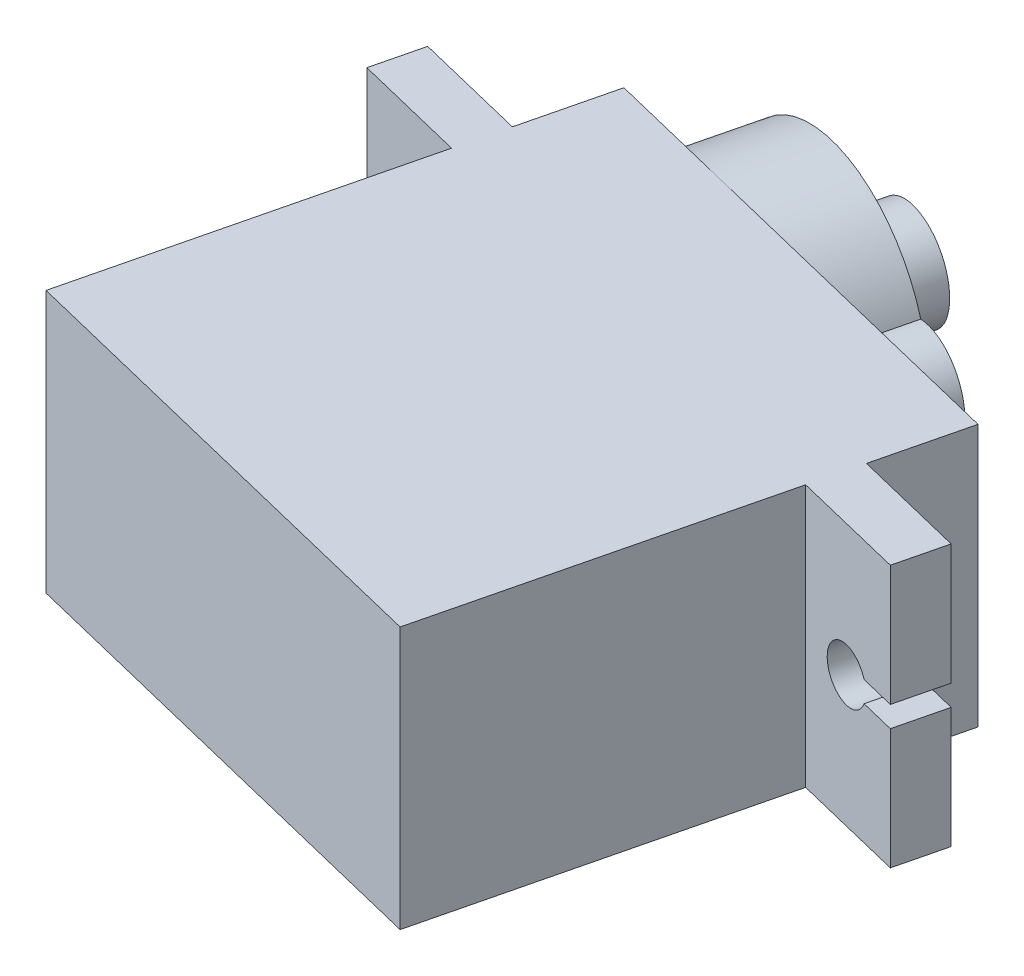
ISO-10303-21;
HEADER;
FILE_DESCRIPTION(('STEP AP214'),'2;1');
FILE_NAME('part.step','',(''),(''),'','','');
FILE_SCHEMA(('AUTOMOTIVE_DESIGN { 1 0 10303 214 1 1 1 1 }'));
ENDSEC;
DATA;
#1=APPLICATION_CONTEXT('core data for automotive mechanical design processes');
#2=APPLICATION_PROTOCOL_DEFINITION('international standard','automotive_design',2000,#1);
#3=PRODUCT_CONTEXT('',#1,'mechanical');
#4=PRODUCT('Part','Part','',(#3));
#5=PRODUCT_RELATED_PRODUCT_CATEGORY('part','',(#4));
#6=PRODUCT_DEFINITION_FORMATION('','',#4);
#7=PRODUCT_DEFINITION_CONTEXT('part definition',#1,'design');
#8=PRODUCT_DEFINITION('design','',#6,#7);
#9=PRODUCT_DEFINITION_SHAPE('','',#8);
#10=(LENGTH_UNIT() NAMED_UNIT(*) SI_UNIT(.MILLI.,.METRE.));
#11=(NAMED_UNIT(*) PLANE_ANGLE_UNIT() SI_UNIT($,.RADIAN.));
#12=(NAMED_UNIT(*) SI_UNIT($,.STERADIAN.) SOLID_ANGLE_UNIT());
#13=UNCERTAINTY_MEASURE_WITH_UNIT(LENGTH_MEASURE(1.E-05),#10,'distance_accuracy_value','');
#14=(GEOMETRIC_REPRESENTATION_CONTEXT(3) GLOBAL_UNCERTAINTY_ASSIGNED_CONTEXT((#13)) GLOBAL_UNIT_ASSIGNED_CONTEXT((#10,
#11,#12)) REPRESENTATION_CONTEXT('',''));
#15=CARTESIAN_POINT('',(0.,0.,0.));
#16=DIRECTION('',(0.,0.,1.));
#17=DIRECTION('',(1.,0.,0.));
#18=AXIS2_PLACEMENT_3D('',#15,#16,#17);
#19=CARTESIAN_POINT('',(-8.17496283968363,12.5,-7.47290010050226));
#20=DIRECTION('',(-0.237248311445867,0.,0.971449040720142));
#21=DIRECTION('',(0.971449040720142,0.,0.237248311445867));
#22=AXIS2_PLACEMENT_3D('',#19,#20,#21);
#23=PLANE('',#22);
#24=DIRECTION('',(-0.971449040720142,0.,-0.237248311445867));
#25=VECTOR('',#24,1.);
#26=CARTESIAN_POINT('',(1.26217181268253,6.75,-5.16815310162581));
#27=LINE('',#26,#25);
#28=CARTESIAN_POINT('',(-6.85798084291024,6.75,-7.15126536533646));
#29=VERTEX_POINT('',#28);
#30=CARTESIAN_POINT('',(-8.17496283968364,6.75,-7.47290010050226));
#31=VERTEX_POINT('',#30);
#32=EDGE_CURVE('E209',#29,#31,#27,.T.);
#33=ORIENTED_EDGE('',*,*,#32,.T.);
#34=DIRECTION('',(0.,-1.,0.));
#35=VECTOR('',#34,1.);
#36=CARTESIAN_POINT('',(-8.17496283968363,12.5,-7.47290010050226));
#37=LINE('',#36,#35);
#38=CARTESIAN_POINT('',(-8.17496283968363,12.5,-7.47290010050226));
#39=VERTEX_POINT('',#38);
#40=EDGE_CURVE('E393',#39,#31,#37,.T.);
#41=ORIENTED_EDGE('',*,*,#40,.F.);
#42=DIRECTION('',(-0.971449040720142,0.,-0.237248311445867));
#43=VECTOR('',#42,1.);
#44=CARTESIAN_POINT('',(-8.17496283968363,12.5,-7.47290010050226));
#45=LINE('',#44,#43);
#46=CARTESIAN_POINT('',(-2.83199311572285,12.5,-6.16803438754999));
#47=VERTEX_POINT('',#46);
#48=EDGE_CURVE('E335',#47,#39,#45,.T.);
#49=ORIENTED_EDGE('',*,*,#48,.F.);
#50=DIRECTION('',(0.,-1.,0.));
#51=VECTOR('',#50,1.);
#52=CARTESIAN_POINT('',(-2.83199311572285,12.5,-6.16803438754999));
#53=LINE('',#52,#51);
#54=CARTESIAN_POINT('',(-2.83199311572285,0.,-6.16803438754999));
#55=VERTEX_POINT('',#54);
#56=EDGE_CURVE('E397',#47,#55,#53,.T.);
#57=ORIENTED_EDGE('',*,*,#56,.T.);
#58=DIRECTION('',(-0.971449040720142,0.,-0.237248311445867));
#59=VECTOR('',#58,1.);
#60=CARTESIAN_POINT('',(-8.17496283968363,0.,-7.47290010050226));
#61=LINE('',#60,#59);
#62=CARTESIAN_POINT('',(-8.17496283968363,0.,-7.47290010050226));
#63=VERTEX_POINT('',#62);
#64=EDGE_CURVE('E376',#55,#63,#61,.T.);
#65=ORIENTED_EDGE('',*,*,#64,.T.);
#66=CARTESIAN_POINT('',(-8.17496283968364,5.75,-7.47290010050226));
#67=VERTEX_POINT('',#66);
#68=EDGE_CURVE('E223',#67,#63,#37,.T.);
#69=ORIENTED_EDGE('',*,*,#68,.F.);
#70=DIRECTION('',(0.971449040720142,0.,0.237248311445867));
#71=VECTOR('',#70,1.);
#72=CARTESIAN_POINT('',(1.26217181268253,5.75,-5.16815310162581));
#73=LINE('',#72,#71);
#74=CARTESIAN_POINT('',(-6.85798084291024,5.75,-7.15126536533646));
#75=VERTEX_POINT('',#74);
#76=EDGE_CURVE('E204',#67,#75,#73,.T.);
#77=ORIENTED_EDGE('',*,*,#76,.T.);
#78=CARTESIAN_POINT('',(-5.40633307363123,6.25,-6.79674241288154));
#79=DIRECTION('',(0.237248311445867,0.,-0.971449040720142));
#80=DIRECTION('',(-0.971449040720142,0.,-0.237248311445867));
#81=AXIS2_PLACEMENT_3D('',#78,#79,#80);
#82=CIRCLE('',#81,1.57574356094831);
#83=EDGE_CURVE('E212',#29,#75,#82,.T.);
#84=ORIENTED_EDGE('',*,*,#83,.F.);
#85=EDGE_LOOP('',(#33,#41,#49,#57,#65,#69,#77,#84));
#86=FACE_BOUND('',#85,.T.);
#87=ADVANCED_FACE('F43',(#86),#23,.F.);
#88=CARTESIAN_POINT('',(-8.74435878715372,12.5,-5.14142240277392));
#89=DIRECTION('',(0.971449040720142,0.,0.237248311445868));
#90=DIRECTION('',(0.237248311445868,0.,-0.971449040720142));
#91=AXIS2_PLACEMENT_3D('',#88,#89,#90);
#92=PLANE('',#91);
#93=DIRECTION('',(0.237248311445867,0.,-0.971449040720142));
#94=VECTOR('',#93,1.);
#95=CARTESIAN_POINT('',(-8.93415743631041,6.75,-4.3642631701978));
#96=LINE('',#95,#94);
#97=CARTESIAN_POINT('',(-8.74435878715372,6.75,-5.14142240277392));
#98=VERTEX_POINT('',#97);
#99=EDGE_CURVE('E231',#98,#31,#96,.T.);
#100=ORIENTED_EDGE('',*,*,#99,.F.);
#101=DIRECTION('',(0.,-1.,0.));
#102=VECTOR('',#101,1.);
#103=CARTESIAN_POINT('',(-8.74435878715372,12.5,-5.14142240277392));
#104=LINE('',#103,#102);
#105=CARTESIAN_POINT('',(-8.74435878715372,12.5,-5.14142240277392));
#106=VERTEX_POINT('',#105);
#107=EDGE_CURVE('E389',#106,#98,#104,.T.);
#108=ORIENTED_EDGE('',*,*,#107,.F.);
#109=DIRECTION('',(-0.237248311445868,0.,0.971449040720142));
#110=VECTOR('',#109,1.);
#111=CARTESIAN_POINT('',(-8.74435878715372,12.5,-5.14142240277392));
#112=LINE('',#111,#110);
#113=EDGE_CURVE('E338',#39,#106,#112,.T.);
#114=ORIENTED_EDGE('',*,*,#113,.F.);
#115=ORIENTED_EDGE('',*,*,#40,.T.);
#116=EDGE_LOOP('',(#100,#108,#114,#115));
#117=FACE_BOUND('',#116,.T.);
#118=ADVANCED_FACE('F449',(#117),#92,.F.);
#119=DIRECTION('',(0.237248311445867,0.,-0.971449040720142));
#120=VECTOR('',#119,1.);
#121=CARTESIAN_POINT('',(-8.93415743631041,5.75,-4.3642631701978));
#122=LINE('',#121,#120);
#123=CARTESIAN_POINT('',(-8.74435878715372,5.75,-5.14142240277392));
#124=VERTEX_POINT('',#123);
#125=EDGE_CURVE('E59',#124,#67,#122,.T.);
#126=ORIENTED_EDGE('',*,*,#125,.T.);
#127=ORIENTED_EDGE('',*,*,#68,.T.);
#128=DIRECTION('',(-0.237248311445868,0.,0.971449040720142));
#129=VECTOR('',#128,1.);
#130=CARTESIAN_POINT('',(-8.74435878715372,0.,-5.14142240277392));
#131=LINE('',#130,#129);
#132=CARTESIAN_POINT('',(-8.74435878715372,0.,-5.14142240277392));
#133=VERTEX_POINT('',#132);
#134=EDGE_CURVE('E379',#63,#133,#131,.T.);
#135=ORIENTED_EDGE('',*,*,#134,.T.);
#136=EDGE_CURVE('E388',#124,#133,#104,.T.);
#137=ORIENTED_EDGE('',*,*,#136,.F.);
#138=EDGE_LOOP('',(#126,#127,#135,#137));
#139=FACE_BOUND('',#138,.T.);
#140=ADVANCED_FACE('F467',(#139),#92,.F.);
#141=CARTESIAN_POINT('',(-3.40138906319294,12.5,-3.83655668982165));
#142=DIRECTION('',(0.237248311445867,0.,-0.971449040720142));
#143=DIRECTION('',(-0.971449040720142,0.,-0.237248311445867));
#144=AXIS2_PLACEMENT_3D('',#141,#142,#143);
#145=PLANE('',#144);
#146=DIRECTION('',(-0.971449040720142,0.,-0.237248311445867));
#147=VECTOR('',#146,1.);
#148=CARTESIAN_POINT('',(-3.40138906319294,6.75,-3.83655668982165));
#149=LINE('',#148,#147);
#150=CARTESIAN_POINT('',(-7.42737679038032,6.75,-4.81978766760811));
#151=VERTEX_POINT('',#150);
#152=EDGE_CURVE('E11',#151,#98,#149,.T.);
#153=ORIENTED_EDGE('',*,*,#152,.F.);
#154=CARTESIAN_POINT('',(-5.97572902110131,6.25,-4.46526471515319));
#155=DIRECTION('',(0.237248311445867,0.,-0.971449040720142));
#156=DIRECTION('',(-0.971449040720142,0.,-0.237248311445867));
#157=AXIS2_PLACEMENT_3D('',#154,#155,#156);
#158=CIRCLE('',#157,1.57574356094831);
#159=CARTESIAN_POINT('',(-7.42737679038032,5.75,-4.81978766760811));
#160=VERTEX_POINT('',#159);
#161=EDGE_CURVE('E52',#151,#160,#158,.T.);
#162=ORIENTED_EDGE('',*,*,#161,.T.);
#163=DIRECTION('',(0.971449040720142,0.,0.237248311445867));
#164=VECTOR('',#163,1.);
#165=CARTESIAN_POINT('',(-3.40138906319294,5.75,-3.83655668982165));
#166=LINE('',#165,#164);
#167=EDGE_CURVE('E205',#124,#160,#166,.T.);
#168=ORIENTED_EDGE('',*,*,#167,.F.);
#169=ORIENTED_EDGE('',*,*,#136,.T.);
#170=DIRECTION('',(0.971449040720142,0.,0.237248311445867));
#171=VECTOR('',#170,1.);
#172=CARTESIAN_POINT('',(-3.40138906319294,0.,-3.83655668982165));
#173=LINE('',#172,#171);
#174=CARTESIAN_POINT('',(-3.40138906319294,0.,-3.83655668982165));
#175=VERTEX_POINT('',#174);
#176=EDGE_CURVE('E309',#133,#175,#173,.T.);
#177=ORIENTED_EDGE('',*,*,#176,.T.);
#178=DIRECTION('',(0.,-1.,0.));
#179=VECTOR('',#178,1.);
#180=CARTESIAN_POINT('',(-3.40138906319294,12.5,-3.83655668982165));
#181=LINE('',#180,#179);
#182=CARTESIAN_POINT('',(-3.40138906319294,12.5,-3.83655668982165));
#183=VERTEX_POINT('',#182);
#184=EDGE_CURVE('E344',#183,#175,#181,.T.);
#185=ORIENTED_EDGE('',*,*,#184,.F.);
#186=DIRECTION('',(0.971449040720142,0.,0.237248311445867));
#187=VECTOR('',#186,1.);
#188=CARTESIAN_POINT('',(-3.40138906319294,12.5,-3.83655668982165));
#189=LINE('',#188,#187);
#190=EDGE_CURVE('E341',#106,#183,#189,.T.);
#191=ORIENTED_EDGE('',*,*,#190,.F.);
#192=ORIENTED_EDGE('',*,*,#107,.T.);
#193=EDGE_LOOP('',(#153,#162,#168,#169,#177,#185,#191,#192));
#194=FACE_BOUND('',#193,.T.);
#195=ADVANCED_FACE('F440',(#194),#145,.F.);
#196=CARTESIAN_POINT('',(24.2849085973311,12.5,2.92502018638558));
#197=DIRECTION('',(-0.971449040720142,0.,-0.237248311445867));
#198=DIRECTION('',(-0.237248311445867,0.,0.971449040720143));
#199=AXIS2_PLACEMENT_3D('',#196,#197,#198);
#200=PLANE('',#199);
#201=DIRECTION('',(0.237248311445867,0.,-0.971449040720142));
#202=VECTOR('',#201,1.);
#203=CARTESIAN_POINT('',(24.0951099481744,6.75,3.70217941896168));
#204=LINE('',#203,#202);
#205=CARTESIAN_POINT('',(24.2849085973311,6.75,2.92502018638558));
#206=VERTEX_POINT('',#205);
#207=CARTESIAN_POINT('',(24.8543045448012,6.75,0.593542488657229));
#208=VERTEX_POINT('',#207);
#209=EDGE_CURVE('E254',#206,#208,#204,.T.);
#210=ORIENTED_EDGE('',*,*,#209,.T.);
#211=DIRECTION('',(0.,-1.,0.));
#212=VECTOR('',#211,1.);
#213=CARTESIAN_POINT('',(24.8543045448012,12.5,0.593542488657231));
#214=LINE('',#213,#212);
#215=CARTESIAN_POINT('',(24.8543045448012,12.5,0.593542488657231));
#216=VERTEX_POINT('',#215);
#217=EDGE_CURVE('E415',#216,#208,#214,.T.);
#218=ORIENTED_EDGE('',*,*,#217,.F.);
#219=DIRECTION('',(0.237248311445867,0.,-0.971449040720142));
#220=VECTOR('',#219,1.);
#221=CARTESIAN_POINT('',(24.2849085973311,12.5,2.92502018638558));
#222=LINE('',#221,#220);
#223=CARTESIAN_POINT('',(24.2849085973311,12.5,2.92502018638558));
#224=VERTEX_POINT('',#223);
#225=EDGE_CURVE('E318',#224,#216,#222,.T.);
#226=ORIENTED_EDGE('',*,*,#225,.F.);
#227=DIRECTION('',(0.,-1.,0.));
#228=VECTOR('',#227,1.);
#229=CARTESIAN_POINT('',(24.2849085973311,12.5,2.92502018638558));
#230=LINE('',#229,#228);
#231=EDGE_CURVE('E420',#224,#206,#230,.T.);
#232=ORIENTED_EDGE('',*,*,#231,.T.);
#233=EDGE_LOOP('',(#210,#218,#226,#232));
#234=FACE_BOUND('',#233,.T.);
#235=ADVANCED_FACE('F539',(#234),#200,.F.);
#236=CARTESIAN_POINT('',(20.5552273912022,12.5,-4.98569900346368));
#237=DIRECTION('',(-0.237248311445867,0.,0.971449040720142));
#238=DIRECTION('',(0.971449040720143,0.,0.237248311445867));
#239=AXIS2_PLACEMENT_3D('',#236,#237,#238);
#240=PLANE('',#239);
#241=CARTESIAN_POINT('',(4.28345595913985,6.25,-8.95960822018195));
#242=DIRECTION('',(0.237248311445867,0.,-0.971449040720142));
#243=DIRECTION('',(-0.971449040720143,0.,-0.237248311445867));
#244=AXIS2_PLACEMENT_3D('',#241,#242,#243);
#245=CIRCLE('',#244,6.25);
#246=CARTESIAN_POINT('',(9.9073687456769,3.89465217855197,-7.58613029555954));
#247=VERTEX_POINT('',#246);
#248=CARTESIAN_POINT('',(4.28345595913985,0.,-8.95960822018195));
#249=VERTEX_POINT('',#248);
#250=EDGE_CURVE('E274',#247,#249,#245,.T.);
#251=ORIENTED_EDGE('',*,*,#250,.F.);
#252=CARTESIAN_POINT('',(10.3550124636407,6.25,-7.47680627364529));
#253=DIRECTION('',(0.237248311445867,0.,-0.971449040720142));
#254=DIRECTION('',(-0.971449040720143,0.,-0.237248311445867));
#255=AXIS2_PLACEMENT_3D('',#252,#253,#254);
#256=CIRCLE('',#255,2.4);
#257=CARTESIAN_POINT('',(9.9073687456769,8.60534782144803,-7.58613029555954));
#258=VERTEX_POINT('',#257);
#259=EDGE_CURVE('E285',#258,#247,#256,.T.);
#260=ORIENTED_EDGE('',*,*,#259,.F.);
#261=CARTESIAN_POINT('',(4.28345595913985,12.5,-8.95960822018195));
#262=VERTEX_POINT('',#261);
#263=EDGE_CURVE('E292',#262,#258,#245,.T.);
#264=ORIENTED_EDGE('',*,*,#263,.F.);
#265=DIRECTION('',(-0.971449040720143,0.,-0.237248311445867));
#266=VECTOR('',#265,1.);
#267=CARTESIAN_POINT('',(20.5552273912022,12.5,-4.98569900346368));
#268=LINE('',#267,#266);
#269=CARTESIAN_POINT('',(20.5552273912022,12.5,-4.98569900346368));
#270=VERTEX_POINT('',#269);
#271=EDGE_CURVE('E328',#270,#262,#268,.T.);
#272=ORIENTED_EDGE('',*,*,#271,.F.);
#273=DIRECTION('',(0.,-1.,0.));
#274=VECTOR('',#273,1.);
#275=CARTESIAN_POINT('',(20.5552273912022,12.5,-4.98569900346368));
#276=LINE('',#275,#274);
#277=CARTESIAN_POINT('',(20.5552273912022,0.,-4.98569900346368));
#278=VERTEX_POINT('',#277);
#279=EDGE_CURVE('E406',#270,#278,#276,.T.);
#280=ORIENTED_EDGE('',*,*,#279,.T.);
#281=DIRECTION('',(-0.971449040720143,0.,-0.237248311445867));
#282=VECTOR('',#281,1.);
#283=CARTESIAN_POINT('',(20.5552273912022,0.,-4.98569900346368));
#284=LINE('',#283,#282);
#285=EDGE_CURVE('E369',#278,#249,#284,.T.);
#286=ORIENTED_EDGE('',*,*,#285,.T.);
#287=EDGE_LOOP('',(#251,#260,#264,#272,#280,#286));
#288=FACE_BOUND('',#287,.T.);
#289=ADVANCED_FACE('F480',(#288),#240,.F.);
#290=CARTESIAN_POINT('',(-1.78810054536104,6.25,-10.4424101667186));
#291=VERTEX_POINT('',#290);
#292=EDGE_CURVE('E279',#249,#291,#245,.T.);
#293=ORIENTED_EDGE('',*,*,#292,.F.);
#294=CARTESIAN_POINT('',(-1.78810054536104,0.,-10.4424101667186));
#295=VERTEX_POINT('',#294);
#296=EDGE_CURVE('E368',#249,#295,#284,.T.);
#297=ORIENTED_EDGE('',*,*,#296,.T.);
#298=DIRECTION('',(0.,-1.,0.));
#299=VECTOR('',#298,1.);
#300=CARTESIAN_POINT('',(-1.78810054536104,12.5,-10.4424101667186));
#301=LINE('',#300,#299);
#302=EDGE_CURVE('E401',#291,#295,#301,.T.);
#303=ORIENTED_EDGE('',*,*,#302,.F.);
#304=EDGE_LOOP('',(#293,#297,#303));
#305=FACE_BOUND('',#304,.T.);
#306=ADVANCED_FACE('F475',(#305),#240,.F.);
#307=CARTESIAN_POINT('',(-7.19736204632682,12.5,11.7066279617006));
#308=DIRECTION('',(0.971449040720142,0.,0.237248311445867));
#309=DIRECTION('',(0.237248311445867,0.,-0.971449040720142));
#310=AXIS2_PLACEMENT_3D('',#307,#308,#309);
#311=PLANE('',#310);
#312=DIRECTION('',(-0.237248311445867,0.,0.971449040720142));
#313=VECTOR('',#312,1.);
#314=CARTESIAN_POINT('',(-7.19736204632682,0.,11.7066279617006));
#315=LINE('',#314,#313);
#316=CARTESIAN_POINT('',(-7.19736204632682,0.,11.7066279617006));
#317=VERTEX_POINT('',#316);
#318=EDGE_CURVE('E303',#175,#317,#315,.T.);
#319=ORIENTED_EDGE('',*,*,#318,.T.);
#320=DIRECTION('',(0.,-1.,0.));
#321=VECTOR('',#320,1.);
#322=CARTESIAN_POINT('',(-7.19736204632682,12.5,11.7066279617006));
#323=LINE('',#322,#321);
#324=CARTESIAN_POINT('',(-7.19736204632682,12.5,11.7066279617006));
#325=VERTEX_POINT('',#324);
#326=EDGE_CURVE('E432',#325,#317,#323,.T.);
#327=ORIENTED_EDGE('',*,*,#326,.F.);
#328=DIRECTION('',(-0.237248311445867,0.,0.971449040720142));
#329=VECTOR('',#328,1.);
#330=CARTESIAN_POINT('',(-7.19736204632682,12.5,11.7066279617006));
#331=LINE('',#330,#329);
#332=EDGE_CURVE('E304',#183,#325,#331,.T.);
#333=ORIENTED_EDGE('',*,*,#332,.F.);
#334=ORIENTED_EDGE('',*,*,#184,.T.);
#335=EDGE_LOOP('',(#319,#327,#333,#334));
#336=FACE_BOUND('',#335,.T.);
#337=ADVANCED_FACE('F45',(#336),#311,.F.);
#338=CARTESIAN_POINT('',(-7.19736204632682,12.5,11.7066279617006));
#339=DIRECTION('',(0.237248311445867,0.,-0.971449040720142));
#340=DIRECTION('',(-0.971449040720142,0.,-0.237248311445867));
#341=AXIS2_PLACEMENT_3D('',#338,#339,#340);
#342=PLANE('',#341);
#343=DIRECTION('',(0.971449040720142,0.,0.237248311445867));
#344=VECTOR('',#343,1.);
#345=CARTESIAN_POINT('',(-7.19736204632682,0.,11.7066279617006));
#346=LINE('',#345,#344);
#347=CARTESIAN_POINT('',(15.1459658902365,0.,17.1633391249556));
#348=VERTEX_POINT('',#347);
#349=EDGE_CURVE('E348',#317,#348,#346,.T.);
#350=ORIENTED_EDGE('',*,*,#349,.T.);
#351=DIRECTION('',(0.,-1.,0.));
#352=VECTOR('',#351,1.);
#353=CARTESIAN_POINT('',(15.1459658902365,12.5,17.1633391249556));
#354=LINE('',#353,#352);
#355=CARTESIAN_POINT('',(15.1459658902365,12.5,17.1633391249556));
#356=VERTEX_POINT('',#355);
#357=EDGE_CURVE('E428',#356,#348,#354,.T.);
#358=ORIENTED_EDGE('',*,*,#357,.F.);
#359=DIRECTION('',(0.971449040720142,0.,0.237248311445867));
#360=VECTOR('',#359,1.);
#361=CARTESIAN_POINT('',(-7.19736204632682,12.5,11.7066279617006));
#362=LINE('',#361,#360);
#363=EDGE_CURVE('E308',#325,#356,#362,.T.);
#364=ORIENTED_EDGE('',*,*,#363,.F.);
#365=ORIENTED_EDGE('',*,*,#326,.T.);
#366=EDGE_LOOP('',(#350,#358,#364,#365));
#367=FACE_BOUND('',#366,.T.);
#368=ADVANCED_FACE('F530',(#367),#342,.F.);
#369=CARTESIAN_POINT('',(15.1459658902365,12.5,17.1633391249556));
#370=DIRECTION('',(-0.971449040720142,0.,-0.237248311445867));
#371=DIRECTION('',(-0.237248311445867,0.,0.971449040720142));
#372=AXIS2_PLACEMENT_3D('',#369,#370,#371);
#373=PLANE('',#372);
#374=DIRECTION('',(0.237248311445867,0.,-0.971449040720142));
#375=VECTOR('',#374,1.);
#376=CARTESIAN_POINT('',(15.1459658902365,0.,17.1633391249556));
#377=LINE('',#376,#375);
#378=CARTESIAN_POINT('',(18.9419388733703,0.,1.62015447343331));
#379=VERTEX_POINT('',#378);
#380=EDGE_CURVE('E351',#348,#379,#377,.T.);
#381=ORIENTED_EDGE('',*,*,#380,.T.);
#382=DIRECTION('',(0.,-1.,0.));
#383=VECTOR('',#382,1.);
#384=CARTESIAN_POINT('',(18.9419388733703,12.5,1.62015447343331));
#385=LINE('',#384,#383);
#386=CARTESIAN_POINT('',(18.9419388733703,12.5,1.62015447343331));
#387=VERTEX_POINT('',#386);
#388=EDGE_CURVE('E424',#387,#379,#385,.T.);
#389=ORIENTED_EDGE('',*,*,#388,.F.);
#390=DIRECTION('',(0.237248311445867,0.,-0.971449040720142));
#391=VECTOR('',#390,1.);
#392=CARTESIAN_POINT('',(15.1459658902365,12.5,17.1633391249556));
#393=LINE('',#392,#391);
#394=EDGE_CURVE('E312',#356,#387,#393,.T.);
#395=ORIENTED_EDGE('',*,*,#394,.F.);
#396=ORIENTED_EDGE('',*,*,#357,.T.);
#397=EDGE_LOOP('',(#381,#389,#395,#396));
#398=FACE_BOUND('',#397,.T.);
#399=ADVANCED_FACE('F526',(#398),#373,.F.);
#400=CARTESIAN_POINT('',(18.9419388733703,12.5,1.62015447343331));
#401=DIRECTION('',(0.237248311445867,0.,-0.971449040720142));
#402=DIRECTION('',(-0.971449040720142,0.,-0.237248311445867));
#403=AXIS2_PLACEMENT_3D('',#400,#401,#402);
#404=PLANE('',#403);
#405=CARTESIAN_POINT('',(24.2849085973311,5.75,2.92502018638558));
#406=VERTEX_POINT('',#405);
#407=CARTESIAN_POINT('',(24.2849085973311,0.,2.92502018638558));
#408=VERTEX_POINT('',#407);
#409=EDGE_CURVE('E419',#406,#408,#230,.T.);
#410=ORIENTED_EDGE('',*,*,#409,.F.);
#411=DIRECTION('',(-0.971449040720142,0.,-0.237248311445867));
#412=VECTOR('',#411,1.);
#413=CARTESIAN_POINT('',(18.9419388733703,5.75,1.62015447343331));
#414=LINE('',#413,#412);
#415=CARTESIAN_POINT('',(22.6292135220018,5.75,2.52066458519015));
#416=VERTEX_POINT('',#415);
#417=EDGE_CURVE('E262',#406,#416,#414,.T.);
#418=ORIENTED_EDGE('',*,*,#417,.T.);
#419=CARTESIAN_POINT('',(21.5162788312787,6.25,2.24886249876486));
#420=DIRECTION('',(0.237248311445867,0.,-0.971449040720142));
#421=DIRECTION('',(-0.971449040720142,0.,-0.237248311445867));
#422=AXIS2_PLACEMENT_3D('',#419,#420,#421);
#423=CIRCLE('',#422,1.25);
#424=CARTESIAN_POINT('',(22.6292135220018,6.75,2.52066458519015));
#425=VERTEX_POINT('',#424);
#426=EDGE_CURVE('E266',#416,#425,#423,.T.);
#427=ORIENTED_EDGE('',*,*,#426,.T.);
#428=DIRECTION('',(-0.971449040720142,0.,-0.237248311445867));
#429=VECTOR('',#428,1.);
#430=CARTESIAN_POINT('',(18.9419388733703,6.75,1.62015447343331));
#431=LINE('',#430,#429);
#432=EDGE_CURVE('E250',#206,#425,#431,.T.);
#433=ORIENTED_EDGE('',*,*,#432,.F.);
#434=ORIENTED_EDGE('',*,*,#231,.F.);
#435=DIRECTION('',(0.971449040720142,0.,0.237248311445867));
#436=VECTOR('',#435,1.);
#437=CARTESIAN_POINT('',(18.9419388733703,12.5,1.62015447343331));
#438=LINE('',#437,#436);
#439=EDGE_CURVE('E315',#387,#224,#438,.T.);
#440=ORIENTED_EDGE('',*,*,#439,.F.);
#441=ORIENTED_EDGE('',*,*,#388,.T.);
#442=DIRECTION('',(0.971449040720142,0.,0.237248311445867));
#443=VECTOR('',#442,1.);
#444=CARTESIAN_POINT('',(18.9419388733703,0.,1.62015447343331));
#445=LINE('',#444,#443);
#446=EDGE_CURVE('E354',#379,#408,#445,.T.);
#447=ORIENTED_EDGE('',*,*,#446,.T.);
#448=EDGE_LOOP('',(#410,#418,#427,#433,#434,#440,#441,#447));
#449=FACE_BOUND('',#448,.T.);
#450=ADVANCED_FACE('F521',(#449),#404,.F.);
#451=CARTESIAN_POINT('',(24.8543045448012,5.75,0.593542488657229));
#452=VERTEX_POINT('',#451);
#453=CARTESIAN_POINT('',(24.8543045448012,0.,0.593542488657231));
#454=VERTEX_POINT('',#453);
#455=EDGE_CURVE('E414',#452,#454,#214,.T.);
#456=ORIENTED_EDGE('',*,*,#455,.F.);
#457=DIRECTION('',(0.237248311445867,0.,-0.971449040720142));
#458=VECTOR('',#457,1.);
#459=CARTESIAN_POINT('',(24.0951099481744,5.75,3.70217941896168));
#460=LINE('',#459,#458);
#461=EDGE_CURVE('E251',#406,#452,#460,.T.);
#462=ORIENTED_EDGE('',*,*,#461,.F.);
#463=ORIENTED_EDGE('',*,*,#409,.T.);
#464=DIRECTION('',(0.237248311445867,0.,-0.971449040720142));
#465=VECTOR('',#464,1.);
#466=CARTESIAN_POINT('',(24.2849085973311,0.,2.92502018638558));
#467=LINE('',#466,#465);
#468=EDGE_CURVE('E358',#408,#454,#467,.T.);
#469=ORIENTED_EDGE('',*,*,#468,.T.);
#470=EDGE_LOOP('',(#456,#462,#463,#469));
#471=FACE_BOUND('',#470,.T.);
#472=ADVANCED_FACE('F518',(#471),#200,.F.);
#473=CARTESIAN_POINT('',(24.8543045448012,12.5,0.593542488657231));
#474=DIRECTION('',(-0.237248311445867,0.,0.971449040720142));
#475=DIRECTION('',(0.971449040720142,0.,0.237248311445867));
#476=AXIS2_PLACEMENT_3D('',#473,#474,#475);
#477=PLANE('',#476);
#478=CARTESIAN_POINT('',(22.0856747787488,6.25,-0.0826151989634909));
#479=DIRECTION('',(0.237248311445867,0.,-0.971449040720142));
#480=DIRECTION('',(-0.971449040720142,0.,-0.237248311445867));
#481=AXIS2_PLACEMENT_3D('',#478,#479,#480);
#482=CIRCLE('',#481,1.25);
#483=CARTESIAN_POINT('',(23.1986094694719,5.75,0.189186887461797));
#484=VERTEX_POINT('',#483);
#485=CARTESIAN_POINT('',(23.1986094694719,6.75,0.189186887461797));
#486=VERTEX_POINT('',#485);
#487=EDGE_CURVE('E67',#484,#486,#482,.T.);
#488=ORIENTED_EDGE('',*,*,#487,.F.);
#489=DIRECTION('',(-0.971449040720142,0.,-0.237248311445867));
#490=VECTOR('',#489,1.);
#491=CARTESIAN_POINT('',(1.26217181268253,5.75,-5.1681531016258));
#492=LINE('',#491,#490);
#493=EDGE_CURVE('E242',#452,#484,#492,.T.);
#494=ORIENTED_EDGE('',*,*,#493,.F.);
#495=ORIENTED_EDGE('',*,*,#455,.T.);
#496=DIRECTION('',(-0.971449040720142,0.,-0.237248311445867));
#497=VECTOR('',#496,1.);
#498=CARTESIAN_POINT('',(24.8543045448012,0.,0.593542488657231));
#499=LINE('',#498,#497);
#500=CARTESIAN_POINT('',(19.5113348208404,0.,-0.711323224295037));
#501=VERTEX_POINT('',#500);
#502=EDGE_CURVE('E362',#454,#501,#499,.T.);
#503=ORIENTED_EDGE('',*,*,#502,.T.);
#504=DIRECTION('',(0.,-1.,0.));
#505=VECTOR('',#504,1.);
#506=CARTESIAN_POINT('',(19.5113348208404,12.5,-0.711323224295037));
#507=LINE('',#506,#505);
#508=CARTESIAN_POINT('',(19.5113348208404,12.5,-0.711323224295037));
#509=VERTEX_POINT('',#508);
#510=EDGE_CURVE('E410',#509,#501,#507,.T.);
#511=ORIENTED_EDGE('',*,*,#510,.F.);
#512=DIRECTION('',(-0.971449040720142,0.,-0.237248311445867));
#513=VECTOR('',#512,1.);
#514=CARTESIAN_POINT('',(24.8543045448012,12.5,0.593542488657231));
#515=LINE('',#514,#513);
#516=EDGE_CURVE('E321',#216,#509,#515,.T.);
#517=ORIENTED_EDGE('',*,*,#516,.F.);
#518=ORIENTED_EDGE('',*,*,#217,.T.);
#519=DIRECTION('',(-0.971449040720142,0.,-0.237248311445867));
#520=VECTOR('',#519,1.);
#521=CARTESIAN_POINT('',(1.26217181268253,6.75,-5.1681531016258));
#522=LINE('',#521,#520);
#523=EDGE_CURVE('E238',#208,#486,#522,.T.);
#524=ORIENTED_EDGE('',*,*,#523,.T.);
#525=EDGE_LOOP('',(#488,#494,#495,#503,#511,#517,#518,#524));
#526=FACE_BOUND('',#525,.T.);
#527=ADVANCED_FACE('F513',(#526),#477,.F.);
#528=CARTESIAN_POINT('',(19.5113348208404,12.5,-0.711323224295037));
#529=DIRECTION('',(-0.971449040720143,0.,-0.237248311445867));
#530=DIRECTION('',(-0.237248311445867,0.,0.971449040720143));
#531=AXIS2_PLACEMENT_3D('',#528,#529,#530);
#532=PLANE('',#531);
#533=DIRECTION('',(0.237248311445867,0.,-0.971449040720142));
#534=VECTOR('',#533,1.);
#535=CARTESIAN_POINT('',(19.5113348208404,0.,-0.711323224295037));
#536=LINE('',#535,#534);
#537=EDGE_CURVE('E365',#501,#278,#536,.T.);
#538=ORIENTED_EDGE('',*,*,#537,.T.);
#539=ORIENTED_EDGE('',*,*,#279,.F.);
#540=DIRECTION('',(0.237248311445867,0.,-0.971449040720142));
#541=VECTOR('',#540,1.);
#542=CARTESIAN_POINT('',(19.5113348208404,12.5,-0.711323224295037));
#543=LINE('',#542,#541);
#544=EDGE_CURVE('E324',#509,#270,#543,.T.);
#545=ORIENTED_EDGE('',*,*,#544,.F.);
#546=ORIENTED_EDGE('',*,*,#510,.T.);
#547=EDGE_LOOP('',(#538,#539,#545,#546));
#548=FACE_BOUND('',#547,.T.);
#549=ADVANCED_FACE('F508',(#548),#532,.F.);
#550=EDGE_CURVE('E493',#291,#262,#245,.T.);
#551=ORIENTED_EDGE('',*,*,#550,.F.);
#552=CARTESIAN_POINT('',(-1.78810054536104,12.5,-10.4424101667186));
#553=VERTEX_POINT('',#552);
#554=EDGE_CURVE('E402',#553,#291,#301,.T.);
#555=ORIENTED_EDGE('',*,*,#554,.F.);
#556=EDGE_CURVE('E327',#262,#553,#268,.T.);
#557=ORIENTED_EDGE('',*,*,#556,.F.);
#558=EDGE_LOOP('',(#551,#555,#557));
#559=FACE_BOUND('',#558,.T.);
#560=ADVANCED_FACE('F503',(#559),#240,.F.);
#561=CARTESIAN_POINT('',(-2.83199311572285,12.5,-6.16803438754999));
#562=DIRECTION('',(0.971449040720142,0.,0.237248311445867));
#563=DIRECTION('',(0.237248311445867,0.,-0.971449040720143));
#564=AXIS2_PLACEMENT_3D('',#561,#562,#563);
#565=PLANE('',#564);
#566=DIRECTION('',(-0.237248311445867,0.,0.971449040720142));
#567=VECTOR('',#566,1.);
#568=CARTESIAN_POINT('',(-2.83199311572285,0.,-6.16803438754999));
#569=LINE('',#568,#567);
#570=EDGE_CURVE('E373',#295,#55,#569,.T.);
#571=ORIENTED_EDGE('',*,*,#570,.T.);
#572=ORIENTED_EDGE('',*,*,#56,.F.);
#573=DIRECTION('',(-0.237248311445867,0.,0.971449040720142));
#574=VECTOR('',#573,1.);
#575=CARTESIAN_POINT('',(-2.83199311572285,12.5,-6.16803438754999));
#576=LINE('',#575,#574);
#577=EDGE_CURVE('E332',#553,#47,#576,.T.);
#578=ORIENTED_EDGE('',*,*,#577,.F.);
#579=ORIENTED_EDGE('',*,*,#554,.T.);
#580=ORIENTED_EDGE('',*,*,#302,.T.);
#581=EDGE_LOOP('',(#571,#572,#578,#579,#580));
#582=FACE_BOUND('',#581,.T.);
#583=ADVANCED_FACE('F500',(#582),#565,.F.);
#584=CARTESIAN_POINT('',(0.,12.5,0.));
#585=DIRECTION('',(0.,1.,0.));
#586=DIRECTION('',(0.,0.,1.));
#587=AXIS2_PLACEMENT_3D('',#584,#585,#586);
#588=PLANE('',#587);
#589=ORIENTED_EDGE('',*,*,#332,.T.);
#590=ORIENTED_EDGE('',*,*,#363,.T.);
#591=ORIENTED_EDGE('',*,*,#394,.T.);
#592=ORIENTED_EDGE('',*,*,#439,.T.);
#593=ORIENTED_EDGE('',*,*,#225,.T.);
#594=ORIENTED_EDGE('',*,*,#516,.T.);
#595=ORIENTED_EDGE('',*,*,#544,.T.);
#596=ORIENTED_EDGE('',*,*,#271,.T.);
#597=ORIENTED_EDGE('',*,*,#556,.T.);
#598=ORIENTED_EDGE('',*,*,#577,.T.);
#599=ORIENTED_EDGE('',*,*,#48,.T.);
#600=ORIENTED_EDGE('',*,*,#113,.T.);
#601=ORIENTED_EDGE('',*,*,#190,.T.);
#602=EDGE_LOOP('',(#589,#590,#591,#592,#593,#594,#595,#596,#597,#598,#599,#600,#601));
#603=FACE_BOUND('',#602,.T.);
#604=ADVANCED_FACE('F453',(#603),#588,.T.);
#605=CARTESIAN_POINT('',(0.,0.,0.));
#606=DIRECTION('',(0.,1.,0.));
#607=DIRECTION('',(0.,0.,1.));
#608=AXIS2_PLACEMENT_3D('',#605,#606,#607);
#609=PLANE('',#608);
#610=ORIENTED_EDGE('',*,*,#318,.F.);
#611=ORIENTED_EDGE('',*,*,#176,.F.);
#612=ORIENTED_EDGE('',*,*,#134,.F.);
#613=ORIENTED_EDGE('',*,*,#64,.F.);
#614=ORIENTED_EDGE('',*,*,#570,.F.);
#615=ORIENTED_EDGE('',*,*,#296,.F.);
#616=ORIENTED_EDGE('',*,*,#285,.F.);
#617=ORIENTED_EDGE('',*,*,#537,.F.);
#618=ORIENTED_EDGE('',*,*,#502,.F.);
#619=ORIENTED_EDGE('',*,*,#468,.F.);
#620=ORIENTED_EDGE('',*,*,#446,.F.);
#621=ORIENTED_EDGE('',*,*,#380,.F.);
#622=ORIENTED_EDGE('',*,*,#349,.F.);
#623=EDGE_LOOP('',(#610,#611,#612,#613,#614,#615,#616,#617,#618,#619,#620,#621,#622));
#624=FACE_BOUND('',#623,.T.);
#625=ADVANCED_FACE('F463',(#624),#609,.F.);
#626=CARTESIAN_POINT('',(5.32734852950167,6.25,-13.2339839993506));
#627=DIRECTION('',(-0.237248311445867,0.,0.971449040720142));
#628=DIRECTION('',(0.971449040720143,0.,0.237248311445867));
#629=AXIS2_PLACEMENT_3D('',#626,#627,#628);
#630=CYLINDRICAL_SURFACE('',#629,6.25);
#631=ORIENTED_EDGE('',*,*,#250,.T.);
#632=ORIENTED_EDGE('',*,*,#292,.T.);
#633=ORIENTED_EDGE('',*,*,#550,.T.);
#634=ORIENTED_EDGE('',*,*,#263,.T.);
#635=DIRECTION('',(-0.237248311445867,0.,0.971449040720142));
#636=VECTOR('',#635,1.);
#637=CARTESIAN_POINT('',(10.9512613160387,8.60534782144803,-11.8605060747282));
#638=LINE('',#637,#636);
#639=CARTESIAN_POINT('',(10.9512613160387,8.60534782144803,-11.8605060747282));
#640=VERTEX_POINT('',#639);
#641=EDGE_CURVE('E299',#640,#258,#638,.T.);
#642=ORIENTED_EDGE('',*,*,#641,.F.);
#643=CARTESIAN_POINT('',(5.32734852950167,6.25,-13.2339839993506));
#644=DIRECTION('',(0.237248311445867,0.,-0.971449040720142));
#645=DIRECTION('',(-0.971449040720143,0.,-0.237248311445867));
#646=AXIS2_PLACEMENT_3D('',#643,#644,#645);
#647=CIRCLE('',#646,6.25);
#648=CARTESIAN_POINT('',(10.9512613160387,3.89465217855197,-11.8605060747282));
#649=VERTEX_POINT('',#648);
#650=EDGE_CURVE('E280',#649,#640,#647,.T.);
#651=ORIENTED_EDGE('',*,*,#650,.F.);
#652=DIRECTION('',(-0.237248311445867,0.,0.971449040720142));
#653=VECTOR('',#652,1.);
#654=CARTESIAN_POINT('',(10.9512613160387,3.89465217855197,-11.8605060747282));
#655=LINE('',#654,#653);
#656=EDGE_CURVE('E288',#649,#247,#655,.T.);
#657=ORIENTED_EDGE('',*,*,#656,.T.);
#658=EDGE_LOOP('',(#631,#632,#633,#634,#642,#651,#657));
#659=FACE_BOUND('',#658,.T.);
#660=ADVANCED_FACE('F484',(#659),#630,.T.);
#661=CARTESIAN_POINT('',(11.3989050340026,6.25,-11.7511820528139));
#662=DIRECTION('',(-0.237248311445867,0.,0.971449040720142));
#663=DIRECTION('',(0.971449040720143,0.,0.237248311445867));
#664=AXIS2_PLACEMENT_3D('',#661,#662,#663);
#665=CYLINDRICAL_SURFACE('',#664,2.4);
#666=ORIENTED_EDGE('',*,*,#259,.T.);
#667=ORIENTED_EDGE('',*,*,#656,.F.);
#668=CARTESIAN_POINT('',(11.3989050340026,6.25,-11.7511820528139));
#669=DIRECTION('',(0.237248311445867,0.,-0.971449040720142));
#670=DIRECTION('',(-0.971449040720143,0.,-0.237248311445867));
#671=AXIS2_PLACEMENT_3D('',#668,#669,#670);
#672=CIRCLE('',#671,2.4);
#673=EDGE_CURVE('E284',#640,#649,#672,.T.);
#674=ORIENTED_EDGE('',*,*,#673,.F.);
#675=ORIENTED_EDGE('',*,*,#641,.T.);
#676=EDGE_LOOP('',(#666,#667,#674,#675));
#677=FACE_BOUND('',#676,.T.);
#678=ADVANCED_FACE('F490',(#677),#665,.T.);
#679=CARTESIAN_POINT('',(3.34995695340616,0.,-13.7169046599631));
#680=DIRECTION('',(0.237248311445867,0.,-0.971449040720142));
#681=DIRECTION('',(-0.971449040720143,0.,-0.237248311445867));
#682=AXIS2_PLACEMENT_3D('',#679,#680,#681);
#683=PLANE('',#682);
#684=CARTESIAN_POINT('',(5.32734852950167,6.25,-13.2339839993506));
#685=DIRECTION('',(0.237248311445867,0.,-0.971449040720142));
#686=DIRECTION('',(-0.971449040720142,0.,-0.237248311445867));
#687=AXIS2_PLACEMENT_3D('',#684,#685,#686);
#688=CIRCLE('',#687,2.4);
#689=CARTESIAN_POINT('',(2.99587083177333,6.25,-13.8033799468207));
#690=VERTEX_POINT('',#689);
#691=EDGE_CURVE('E275',#690,#690,#688,.T.);
#692=ORIENTED_EDGE('',*,*,#691,.F.);
#693=EDGE_LOOP('',(#692));
#694=FACE_BOUND('',#693,.T.);
#695=ORIENTED_EDGE('',*,*,#650,.T.);
#696=ORIENTED_EDGE('',*,*,#673,.T.);
#697=EDGE_LOOP('',(#695,#696));
#698=FACE_BOUND('',#697,.T.);
#699=ADVANCED_FACE('F605',(#694,#698),#683,.T.);
#700=CARTESIAN_POINT('',(6.08654312612844,6.25,-16.342620929655));
#701=DIRECTION('',(-0.237248311445867,0.,0.971449040720142));
#702=DIRECTION('',(0.971449040720142,0.,0.237248311445867));
#703=AXIS2_PLACEMENT_3D('',#700,#701,#702);
#704=CYLINDRICAL_SURFACE('',#703,2.4);
#705=CARTESIAN_POINT('',(6.08654312612844,6.25,-16.342620929655));
#706=DIRECTION('',(0.237248311445867,0.,-0.971449040720142));
#707=DIRECTION('',(-0.971449040720142,0.,-0.237248311445867));
#708=AXIS2_PLACEMENT_3D('',#705,#706,#707);
#709=CIRCLE('',#708,2.4);
#710=CARTESIAN_POINT('',(3.7550654284001,6.25,-16.9120168771251));
#711=VERTEX_POINT('',#710);
#712=EDGE_CURVE('E270',#711,#711,#709,.T.);
#713=ORIENTED_EDGE('',*,*,#712,.F.);
#714=EDGE_LOOP('',(#713));
#715=FACE_BOUND('',#714,.T.);
#716=ORIENTED_EDGE('',*,*,#691,.T.);
#717=EDGE_LOOP('',(#716));
#718=FACE_BOUND('',#717,.T.);
#719=ADVANCED_FACE('F608',(#715,#718),#704,.T.);
#720=CARTESIAN_POINT('',(4.10915155003294,0.,-16.8255415902675));
#721=DIRECTION('',(0.237248311445867,0.,-0.971449040720142));
#722=DIRECTION('',(-0.971449040720142,0.,-0.237248311445867));
#723=AXIS2_PLACEMENT_3D('',#720,#721,#722);
#724=PLANE('',#723);
#725=ORIENTED_EDGE('',*,*,#712,.T.);
#726=EDGE_LOOP('',(#725));
#727=FACE_BOUND('',#726,.T.);
#728=ADVANCED_FACE('F553',(#727),#724,.T.);
#729=CARTESIAN_POINT('',(21.326480182122,6.25,3.02602173134096));
#730=DIRECTION('',(0.237248311445867,0.,-0.971449040720142));
#731=DIRECTION('',(-0.971449040720142,0.,-0.237248311445867));
#732=AXIS2_PLACEMENT_3D('',#729,#730,#731);
#733=CYLINDRICAL_SURFACE('',#732,1.25);
#734=DIRECTION('',(0.237248311445867,0.,-0.971449040720142));
#735=VECTOR('',#734,1.);
#736=CARTESIAN_POINT('',(22.4394148728451,5.75,3.29782381776625));
#737=LINE('',#736,#735);
#738=EDGE_CURVE('E247',#416,#484,#737,.T.);
#739=ORIENTED_EDGE('',*,*,#738,.T.);
#740=ORIENTED_EDGE('',*,*,#487,.T.);
#741=DIRECTION('',(0.237248311445867,0.,-0.971449040720142));
#742=VECTOR('',#741,1.);
#743=CARTESIAN_POINT('',(22.4394148728451,6.75,3.29782381776625));
#744=LINE('',#743,#742);
#745=EDGE_CURVE('E246',#425,#486,#744,.T.);
#746=ORIENTED_EDGE('',*,*,#745,.F.);
#747=ORIENTED_EDGE('',*,*,#426,.F.);
#748=EDGE_LOOP('',(#739,#740,#746,#747));
#749=FACE_BOUND('',#748,.T.);
#750=ADVANCED_FACE('F542',(#749),#733,.F.);
#751=CARTESIAN_POINT('',(0.502977216055751,5.75,-2.05951617132135));
#752=DIRECTION('',(0.,-1.,0.));
#753=DIRECTION('',(0.,0.,-1.));
#754=AXIS2_PLACEMENT_3D('',#751,#752,#753);
#755=PLANE('',#754);
#756=ORIENTED_EDGE('',*,*,#461,.T.);
#757=ORIENTED_EDGE('',*,*,#493,.T.);
#758=ORIENTED_EDGE('',*,*,#738,.F.);
#759=ORIENTED_EDGE('',*,*,#417,.F.);
#760=EDGE_LOOP('',(#756,#757,#758,#759));
#761=FACE_BOUND('',#760,.T.);
#762=ADVANCED_FACE('F545',(#761),#755,.F.);
#763=CARTESIAN_POINT('',(0.502977216055751,6.75,-2.05951617132135));
#764=DIRECTION('',(0.,-1.,0.));
#765=DIRECTION('',(0.,0.,-1.));
#766=AXIS2_PLACEMENT_3D('',#763,#764,#765);
#767=PLANE('',#766);
#768=ORIENTED_EDGE('',*,*,#432,.T.);
#769=ORIENTED_EDGE('',*,*,#745,.T.);
#770=ORIENTED_EDGE('',*,*,#523,.F.);
#771=ORIENTED_EDGE('',*,*,#209,.F.);
#772=EDGE_LOOP('',(#768,#769,#770,#771));
#773=FACE_BOUND('',#772,.T.);
#774=ADVANCED_FACE('F541',(#773),#767,.T.);
#775=CARTESIAN_POINT('',(-6.16552767025801,6.25,-3.68810548257708));
#776=DIRECTION('',(0.237248311445867,0.,-0.971449040720142));
#777=DIRECTION('',(-0.971449040720142,0.,-0.237248311445867));
#778=AXIS2_PLACEMENT_3D('',#775,#776,#777);
#779=CYLINDRICAL_SURFACE('',#778,1.57574356094831);
#780=DIRECTION('',(0.237248311445867,0.,-0.971449040720142));
#781=VECTOR('',#780,1.);
#782=CARTESIAN_POINT('',(-7.61717543953701,6.75,-4.042628435032));
#783=LINE('',#782,#781);
#784=EDGE_CURVE('E215',#151,#29,#783,.T.);
#785=ORIENTED_EDGE('',*,*,#784,.T.);
#786=ORIENTED_EDGE('',*,*,#83,.T.);
#787=DIRECTION('',(0.237248311445867,0.,-0.971449040720142));
#788=VECTOR('',#787,1.);
#789=CARTESIAN_POINT('',(-7.61717543953701,5.75,-4.042628435032));
#790=LINE('',#789,#788);
#791=EDGE_CURVE('E200',#160,#75,#790,.T.);
#792=ORIENTED_EDGE('',*,*,#791,.F.);
#793=ORIENTED_EDGE('',*,*,#161,.F.);
#794=EDGE_LOOP('',(#785,#786,#792,#793));
#795=FACE_BOUND('',#794,.T.);
#796=ADVANCED_FACE('F213',(#795),#779,.F.);
#797=CARTESIAN_POINT('',(0.502977216055753,6.75,-2.05951617132136));
#798=DIRECTION('',(0.,-1.,0.));
#799=DIRECTION('',(0.,0.,-1.));
#800=AXIS2_PLACEMENT_3D('',#797,#798,#799);
#801=PLANE('',#800);
#802=ORIENTED_EDGE('',*,*,#152,.T.);
#803=ORIENTED_EDGE('',*,*,#99,.T.);
#804=ORIENTED_EDGE('',*,*,#32,.F.);
#805=ORIENTED_EDGE('',*,*,#784,.F.);
#806=EDGE_LOOP('',(#802,#803,#804,#805));
#807=FACE_BOUND('',#806,.T.);
#808=ADVANCED_FACE('F443',(#807),#801,.T.);
#809=CARTESIAN_POINT('',(0.502977216055753,5.75,-2.05951617132136));
#810=DIRECTION('',(0.,1.,0.));
#811=DIRECTION('',(0.,0.,1.));
#812=AXIS2_PLACEMENT_3D('',#809,#810,#811);
#813=PLANE('',#812);
#814=ORIENTED_EDGE('',*,*,#167,.T.);
#815=ORIENTED_EDGE('',*,*,#791,.T.);
#816=ORIENTED_EDGE('',*,*,#76,.F.);
#817=ORIENTED_EDGE('',*,*,#125,.F.);
#818=EDGE_LOOP('',(#814,#815,#816,#817));
#819=FACE_BOUND('',#818,.T.);
#820=ADVANCED_FACE('F202',(#819),#813,.T.);
#821=CLOSED_SHELL('',(#87,#118,#140,#195,#235,#289,#306,#337,#368,#399,#450,#472,#527,#549,#560,
#583,#604,#625,#660,#678,#699,#719,#728,#750,#762,#774,#796,#808,#820));
#822=MANIFOLD_SOLID_BREP('B2',#821);
#823=ADVANCED_BREP_SHAPE_REPRESENTATION('',(#18,#822),#14);
#824=SHAPE_DEFINITION_REPRESENTATION(#9,#823);
ENDSEC;
END-ISO-10303-21;
